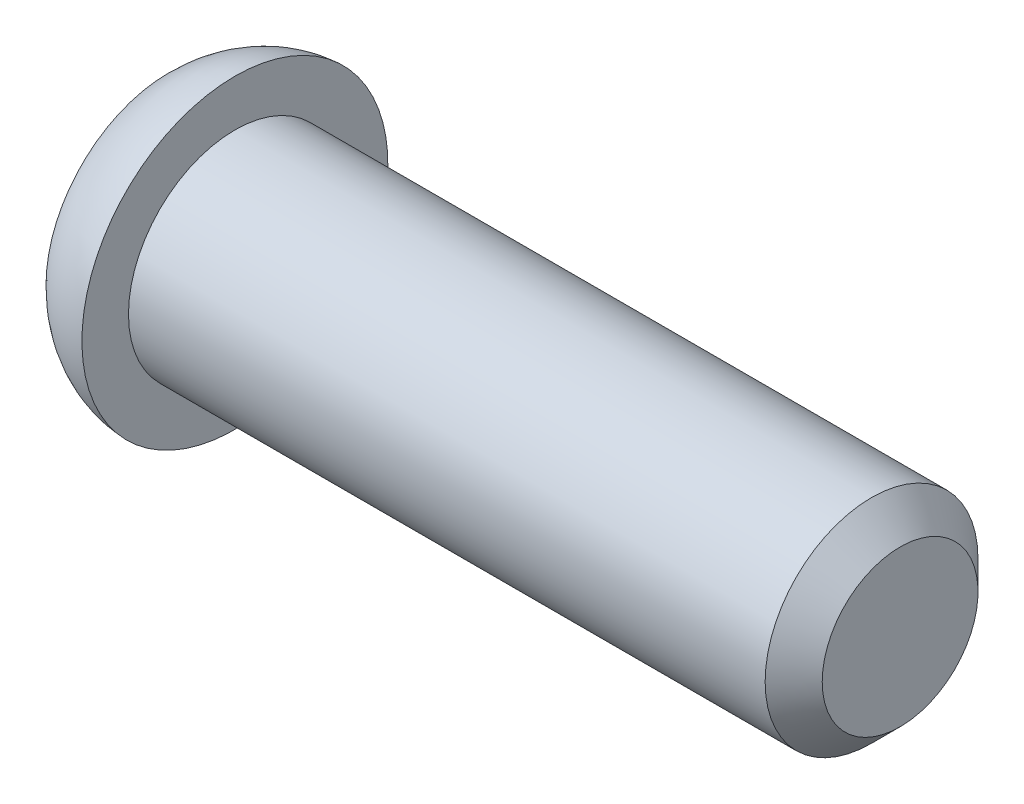
ISO-10303-21;
HEADER;
FILE_DESCRIPTION(('STEP AP214'),'2;1');
FILE_NAME('part.step','',(''),(''),'','','');
FILE_SCHEMA(('AUTOMOTIVE_DESIGN { 1 0 10303 214 1 1 1 1 }'));
ENDSEC;
DATA;
#1=APPLICATION_CONTEXT('core data for automotive mechanical design processes');
#2=APPLICATION_PROTOCOL_DEFINITION('international standard','automotive_design',2000,#1);
#3=PRODUCT_CONTEXT('',#1,'mechanical');
#4=PRODUCT('Part','Part','',(#3));
#5=PRODUCT_RELATED_PRODUCT_CATEGORY('part','',(#4));
#6=PRODUCT_DEFINITION_FORMATION('','',#4);
#7=PRODUCT_DEFINITION_CONTEXT('part definition',#1,'design');
#8=PRODUCT_DEFINITION('design','',#6,#7);
#9=PRODUCT_DEFINITION_SHAPE('','',#8);
#10=(LENGTH_UNIT() NAMED_UNIT(*) SI_UNIT(.MILLI.,.METRE.));
#11=(NAMED_UNIT(*) PLANE_ANGLE_UNIT() SI_UNIT($,.RADIAN.));
#12=(NAMED_UNIT(*) SI_UNIT($,.STERADIAN.) SOLID_ANGLE_UNIT());
#13=UNCERTAINTY_MEASURE_WITH_UNIT(LENGTH_MEASURE(1.E-05),#10,'distance_accuracy_value','');
#14=(GEOMETRIC_REPRESENTATION_CONTEXT(3) GLOBAL_UNCERTAINTY_ASSIGNED_CONTEXT((#13)) GLOBAL_UNIT_ASSIGNED_CONTEXT((#10,
#11,#12)) REPRESENTATION_CONTEXT('',''));
#15=CARTESIAN_POINT('',(0.,0.,0.));
#16=DIRECTION('',(0.,0.,1.));
#17=DIRECTION('',(1.,0.,0.));
#18=AXIS2_PLACEMENT_3D('',#15,#16,#17);
#19=CARTESIAN_POINT('',(0.25,0.115,0.345));
#20=DIRECTION('',(-0.940190624657783,0.,-0.340648777049922));
#21=DIRECTION('',(-0.340648777049922,0.,0.940190624657783));
#22=AXIS2_PLACEMENT_3D('',#19,#20,#21);
#23=PLANE('',#22);
#24=DIRECTION('',(0.340648777049924,0.,-0.940190624657782));
#25=VECTOR('',#24,1.);
#26=CARTESIAN_POINT('',(0.333333333333333,-0.115,0.115));
#27=LINE('',#26,#25);
#28=CARTESIAN_POINT('',(0.333333333333333,-0.115,0.115));
#29=VERTEX_POINT('',#28);
#30=CARTESIAN_POINT('',(0.375,-0.115,0.));
#31=VERTEX_POINT('',#30);
#32=EDGE_CURVE('E125',#29,#31,#27,.T.);
#33=ORIENTED_EDGE('',*,*,#32,.F.);
#34=DIRECTION('',(-0.248182513422005,-0.684983737044733,0.684983737044733));
#35=VECTOR('',#34,1.);
#36=CARTESIAN_POINT('',(0.375,0.,0.));
#37=LINE('',#36,#35);
#38=CARTESIAN_POINT('',(0.375,0.,0.));
#39=VERTEX_POINT('',#38);
#40=EDGE_CURVE('E122',#39,#29,#37,.T.);
#41=ORIENTED_EDGE('',*,*,#40,.F.);
#42=DIRECTION('',(0.,1.,0.));
#43=VECTOR('',#42,1.);
#44=CARTESIAN_POINT('',(0.375,0.115,0.));
#45=LINE('',#44,#43);
#46=EDGE_CURVE('E119',#31,#39,#45,.T.);
#47=ORIENTED_EDGE('',*,*,#46,.F.);
#48=EDGE_LOOP('',(#33,#41,#47));
#49=FACE_BOUND('',#48,.T.);
#50=ADVANCED_FACE('F16',(#49),#23,.T.);
#51=CARTESIAN_POINT('',(0.375,0.115,0.));
#52=DIRECTION('',(-0.940190624657783,0.,0.340648777049922));
#53=DIRECTION('',(0.340648777049922,0.,0.940190624657783));
#54=AXIS2_PLACEMENT_3D('',#51,#52,#53);
#55=PLANE('',#54);
#56=ORIENTED_EDGE('',*,*,#46,.T.);
#57=DIRECTION('',(0.248182513422005,0.684983737044733,0.684983737044733));
#58=VECTOR('',#57,1.);
#59=CARTESIAN_POINT('',(0.333333333333333,-0.115,-0.115));
#60=LINE('',#59,#58);
#61=CARTESIAN_POINT('',(0.333333333333333,-0.115,-0.115));
#62=VERTEX_POINT('',#61);
#63=EDGE_CURVE('E162',#62,#39,#60,.T.);
#64=ORIENTED_EDGE('',*,*,#63,.F.);
#65=DIRECTION('',(-0.340648777049924,0.,-0.940190624657782));
#66=VECTOR('',#65,1.);
#67=CARTESIAN_POINT('',(0.375,-0.115,0.));
#68=LINE('',#67,#66);
#69=EDGE_CURVE('E169',#31,#62,#68,.T.);
#70=ORIENTED_EDGE('',*,*,#69,.F.);
#71=EDGE_LOOP('',(#56,#64,#70));
#72=FACE_BOUND('',#71,.T.);
#73=ADVANCED_FACE('F165',(#72),#55,.T.);
#74=CARTESIAN_POINT('',(0.25,-0.345,0.115));
#75=DIRECTION('',(-0.940190624657783,0.340648777049922,0.));
#76=DIRECTION('',(-0.340648777049922,-0.940190624657783,0.));
#77=AXIS2_PLACEMENT_3D('',#74,#75,#76);
#78=PLANE('',#77);
#79=ORIENTED_EDGE('',*,*,#40,.T.);
#80=DIRECTION('',(0.340648777049924,0.940190624657782,0.));
#81=VECTOR('',#80,1.);
#82=CARTESIAN_POINT('',(0.333333333333333,-0.115,0.115));
#83=LINE('',#82,#81);
#84=CARTESIAN_POINT('',(0.375,0.,0.115));
#85=VERTEX_POINT('',#84);
#86=EDGE_CURVE('E134',#29,#85,#83,.T.);
#87=ORIENTED_EDGE('',*,*,#86,.T.);
#88=DIRECTION('',(0.,0.,1.));
#89=VECTOR('',#88,1.);
#90=CARTESIAN_POINT('',(0.375,0.,0.115));
#91=LINE('',#90,#89);
#92=EDGE_CURVE('E128',#39,#85,#91,.T.);
#93=ORIENTED_EDGE('',*,*,#92,.F.);
#94=EDGE_LOOP('',(#79,#87,#93));
#95=FACE_BOUND('',#94,.T.);
#96=ADVANCED_FACE('F132',(#95),#78,.T.);
#97=CARTESIAN_POINT('',(0.375,0.,0.115));
#98=DIRECTION('',(-0.940190624657783,-0.340648777049922,0.));
#99=DIRECTION('',(0.340648777049922,-0.940190624657783,0.));
#100=AXIS2_PLACEMENT_3D('',#97,#98,#99);
#101=PLANE('',#100);
#102=DIRECTION('',(-0.248182513422005,0.684983737044733,0.684983737044733));
#103=VECTOR('',#102,1.);
#104=CARTESIAN_POINT('',(0.375,0.,0.));
#105=LINE('',#104,#103);
#106=CARTESIAN_POINT('',(0.333333333333333,0.115,0.115));
#107=VERTEX_POINT('',#106);
#108=EDGE_CURVE('E137',#39,#107,#105,.T.);
#109=ORIENTED_EDGE('',*,*,#108,.F.);
#110=ORIENTED_EDGE('',*,*,#92,.T.);
#111=DIRECTION('',(-0.340648777049924,0.940190624657782,0.));
#112=VECTOR('',#111,1.);
#113=CARTESIAN_POINT('',(0.375,0.,0.115));
#114=LINE('',#113,#112);
#115=EDGE_CURVE('E142',#85,#107,#114,.T.);
#116=ORIENTED_EDGE('',*,*,#115,.T.);
#117=EDGE_LOOP('',(#109,#110,#116));
#118=FACE_BOUND('',#117,.T.);
#119=ADVANCED_FACE('F141',(#118),#101,.T.);
#120=CARTESIAN_POINT('',(0.25,0.115,0.345));
#121=DIRECTION('',(-0.940190624657783,0.,-0.340648777049922));
#122=DIRECTION('',(-0.340648777049922,0.,0.940190624657783));
#123=AXIS2_PLACEMENT_3D('',#120,#121,#122);
#124=PLANE('',#123);
#125=DIRECTION('',(0.,1.,0.));
#126=VECTOR('',#125,1.);
#127=CARTESIAN_POINT('',(0.375,0.115,0.));
#128=LINE('',#127,#126);
#129=CARTESIAN_POINT('',(0.375,0.115,0.));
#130=VERTEX_POINT('',#129);
#131=EDGE_CURVE('E145',#39,#130,#128,.T.);
#132=ORIENTED_EDGE('',*,*,#131,.F.);
#133=ORIENTED_EDGE('',*,*,#108,.T.);
#134=DIRECTION('',(0.340648777049924,0.,-0.940190624657782));
#135=VECTOR('',#134,1.);
#136=CARTESIAN_POINT('',(0.333333333333333,0.115,0.115));
#137=LINE('',#136,#135);
#138=EDGE_CURVE('E151',#107,#130,#137,.T.);
#139=ORIENTED_EDGE('',*,*,#138,.T.);
#140=EDGE_LOOP('',(#132,#133,#139));
#141=FACE_BOUND('',#140,.T.);
#142=ADVANCED_FACE('F149',(#141),#124,.T.);
#143=CARTESIAN_POINT('',(0.375,0.115,0.));
#144=DIRECTION('',(-0.940190624657783,0.,0.340648777049922));
#145=DIRECTION('',(0.340648777049922,0.,0.940190624657783));
#146=AXIS2_PLACEMENT_3D('',#143,#144,#145);
#147=PLANE('',#146);
#148=DIRECTION('',(-0.340648777049924,0.,-0.940190624657782));
#149=VECTOR('',#148,1.);
#150=CARTESIAN_POINT('',(0.375,0.115,0.));
#151=LINE('',#150,#149);
#152=CARTESIAN_POINT('',(0.333333333333333,0.115,-0.115));
#153=VERTEX_POINT('',#152);
#154=EDGE_CURVE('E158',#130,#153,#151,.T.);
#155=ORIENTED_EDGE('',*,*,#154,.T.);
#156=DIRECTION('',(-0.248182513422005,0.684983737044733,-0.684983737044733));
#157=VECTOR('',#156,1.);
#158=CARTESIAN_POINT('',(0.375,0.,0.));
#159=LINE('',#158,#157);
#160=EDGE_CURVE('E154',#39,#153,#159,.T.);
#161=ORIENTED_EDGE('',*,*,#160,.F.);
#162=ORIENTED_EDGE('',*,*,#131,.T.);
#163=EDGE_LOOP('',(#155,#161,#162));
#164=FACE_BOUND('',#163,.T.);
#165=ADVANCED_FACE('F157',(#164),#147,.T.);
#166=CARTESIAN_POINT('',(0.375,0.,0.115));
#167=DIRECTION('',(-0.940190624657783,-0.340648777049922,0.));
#168=DIRECTION('',(0.340648777049922,-0.940190624657783,0.));
#169=AXIS2_PLACEMENT_3D('',#166,#167,#168);
#170=PLANE('',#169);
#171=ORIENTED_EDGE('',*,*,#160,.T.);
#172=DIRECTION('',(-0.340648777049924,0.940190624657782,0.));
#173=VECTOR('',#172,1.);
#174=CARTESIAN_POINT('',(0.375,0.,-0.115));
#175=LINE('',#174,#173);
#176=CARTESIAN_POINT('',(0.375,0.,-0.115));
#177=VERTEX_POINT('',#176);
#178=EDGE_CURVE('E175',#177,#153,#175,.T.);
#179=ORIENTED_EDGE('',*,*,#178,.F.);
#180=DIRECTION('',(0.,0.,1.));
#181=VECTOR('',#180,1.);
#182=CARTESIAN_POINT('',(0.375,0.,0.115));
#183=LINE('',#182,#181);
#184=EDGE_CURVE('E172',#39,#177,#183,.F.);
#185=ORIENTED_EDGE('',*,*,#184,.F.);
#186=EDGE_LOOP('',(#171,#179,#185));
#187=FACE_BOUND('',#186,.T.);
#188=ADVANCED_FACE('F173',(#187),#170,.T.);
#189=CARTESIAN_POINT('',(0.25,-0.345,0.115));
#190=DIRECTION('',(-0.940190624657783,0.340648777049922,0.));
#191=DIRECTION('',(-0.340648777049922,-0.940190624657783,0.));
#192=AXIS2_PLACEMENT_3D('',#189,#190,#191);
#193=PLANE('',#192);
#194=ORIENTED_EDGE('',*,*,#63,.T.);
#195=ORIENTED_EDGE('',*,*,#184,.T.);
#196=DIRECTION('',(0.340648777049924,0.940190624657782,0.));
#197=VECTOR('',#196,1.);
#198=CARTESIAN_POINT('',(0.333333333333333,-0.115,-0.115));
#199=LINE('',#198,#197);
#200=EDGE_CURVE('E180',#62,#177,#199,.T.);
#201=ORIENTED_EDGE('',*,*,#200,.F.);
#202=EDGE_LOOP('',(#194,#195,#201));
#203=FACE_BOUND('',#202,.T.);
#204=ADVANCED_FACE('F179',(#203),#193,.T.);
#205=CARTESIAN_POINT('',(0.,-0.115,0.));
#206=DIRECTION('',(0.,1.,0.));
#207=DIRECTION('',(0.,0.,1.));
#208=AXIS2_PLACEMENT_3D('',#205,#206,#207);
#209=PLANE('',#208);
#210=ORIENTED_EDGE('',*,*,#69,.T.);
#211=DIRECTION('',(0.,0.,1.));
#212=VECTOR('',#211,1.);
#213=CARTESIAN_POINT('',(0.333333333333333,-0.115,0.115));
#214=LINE('',#213,#212);
#215=EDGE_CURVE('E301',#29,#62,#214,.F.);
#216=ORIENTED_EDGE('',*,*,#215,.F.);
#217=ORIENTED_EDGE('',*,*,#32,.T.);
#218=EDGE_LOOP('',(#210,#216,#217));
#219=FACE_BOUND('',#218,.T.);
#220=ADVANCED_FACE('F311',(#219),#209,.T.);
#221=CARTESIAN_POINT('',(0.,0.,0.115));
#222=DIRECTION('',(0.,0.,1.));
#223=DIRECTION('',(1.,0.,0.));
#224=AXIS2_PLACEMENT_3D('',#221,#222,#223);
#225=PLANE('',#224);
#226=ORIENTED_EDGE('',*,*,#115,.F.);
#227=ORIENTED_EDGE('',*,*,#86,.F.);
#228=DIRECTION('',(0.,1.,0.));
#229=VECTOR('',#228,1.);
#230=CARTESIAN_POINT('',(0.333333333333333,0.115,0.115));
#231=LINE('',#230,#229);
#232=EDGE_CURVE('E298',#107,#29,#231,.F.);
#233=ORIENTED_EDGE('',*,*,#232,.F.);
#234=EDGE_LOOP('',(#226,#227,#233));
#235=FACE_BOUND('',#234,.T.);
#236=ADVANCED_FACE('F316',(#235),#225,.F.);
#237=CARTESIAN_POINT('',(0.,0.115,0.));
#238=DIRECTION('',(0.,1.,0.));
#239=DIRECTION('',(0.,0.,1.));
#240=AXIS2_PLACEMENT_3D('',#237,#238,#239);
#241=PLANE('',#240);
#242=ORIENTED_EDGE('',*,*,#154,.F.);
#243=ORIENTED_EDGE('',*,*,#138,.F.);
#244=DIRECTION('',(0.,0.,1.));
#245=VECTOR('',#244,1.);
#246=CARTESIAN_POINT('',(0.333333333333333,0.115,0.115));
#247=LINE('',#246,#245);
#248=EDGE_CURVE('E295',#153,#107,#247,.T.);
#249=ORIENTED_EDGE('',*,*,#248,.F.);
#250=EDGE_LOOP('',(#242,#243,#249));
#251=FACE_BOUND('',#250,.T.);
#252=ADVANCED_FACE('F364',(#251),#241,.F.);
#253=CARTESIAN_POINT('',(0.,0.,-0.115));
#254=DIRECTION('',(0.,0.,1.));
#255=DIRECTION('',(1.,0.,0.));
#256=AXIS2_PLACEMENT_3D('',#253,#254,#255);
#257=PLANE('',#256);
#258=DIRECTION('',(0.,1.,0.));
#259=VECTOR('',#258,1.);
#260=CARTESIAN_POINT('',(0.333333333333333,0.115,-0.115));
#261=LINE('',#260,#259);
#262=EDGE_CURVE('E292',#62,#153,#261,.T.);
#263=ORIENTED_EDGE('',*,*,#262,.F.);
#264=ORIENTED_EDGE('',*,*,#200,.T.);
#265=ORIENTED_EDGE('',*,*,#178,.T.);
#266=EDGE_LOOP('',(#263,#264,#265));
#267=FACE_BOUND('',#266,.T.);
#268=ADVANCED_FACE('F362',(#267),#257,.T.);
#269=CARTESIAN_POINT('',(0.25,-0.345,0.115));
#270=DIRECTION('',(-0.940190624657783,0.340648777049922,0.));
#271=DIRECTION('',(-0.340648777049922,-0.940190624657783,0.));
#272=AXIS2_PLACEMENT_3D('',#269,#270,#271);
#273=PLANE('',#272);
#274=DIRECTION('',(0.34064877704992,0.940190624657784,0.));
#275=VECTOR('',#274,1.);
#276=CARTESIAN_POINT('',(0.25,-0.345,-0.115));
#277=LINE('',#276,#275);
#278=CARTESIAN_POINT('',(0.25,-0.345,-0.115));
#279=VERTEX_POINT('',#278);
#280=EDGE_CURVE('E287',#279,#62,#277,.T.);
#281=ORIENTED_EDGE('',*,*,#280,.F.);
#282=DIRECTION('',(0.,0.,1.));
#283=VECTOR('',#282,1.);
#284=CARTESIAN_POINT('',(0.25,-0.345,0.115));
#285=LINE('',#284,#283);
#286=CARTESIAN_POINT('',(0.25,-0.345,0.115));
#287=VERTEX_POINT('',#286);
#288=EDGE_CURVE('E278',#287,#279,#285,.F.);
#289=ORIENTED_EDGE('',*,*,#288,.F.);
#290=DIRECTION('',(0.34064877704992,0.940190624657784,0.));
#291=VECTOR('',#290,1.);
#292=CARTESIAN_POINT('',(0.25,-0.345,0.115));
#293=LINE('',#292,#291);
#294=EDGE_CURVE('E272',#287,#29,#293,.T.);
#295=ORIENTED_EDGE('',*,*,#294,.T.);
#296=ORIENTED_EDGE('',*,*,#215,.T.);
#297=EDGE_LOOP('',(#281,#289,#295,#296));
#298=FACE_BOUND('',#297,.T.);
#299=ADVANCED_FACE('F319',(#298),#273,.T.);
#300=CARTESIAN_POINT('',(0.25,0.115,0.345));
#301=DIRECTION('',(-0.940190624657783,0.,-0.340648777049922));
#302=DIRECTION('',(-0.340648777049922,0.,0.940190624657783));
#303=AXIS2_PLACEMENT_3D('',#300,#301,#302);
#304=PLANE('',#303);
#305=DIRECTION('',(0.,1.,0.));
#306=VECTOR('',#305,1.);
#307=CARTESIAN_POINT('',(0.25,0.115,0.345));
#308=LINE('',#307,#306);
#309=CARTESIAN_POINT('',(0.25,0.115,0.345));
#310=VERTEX_POINT('',#309);
#311=CARTESIAN_POINT('',(0.25,-0.115,0.345));
#312=VERTEX_POINT('',#311);
#313=EDGE_CURVE('E260',#310,#312,#308,.F.);
#314=ORIENTED_EDGE('',*,*,#313,.F.);
#315=DIRECTION('',(0.34064877704992,0.,-0.940190624657784));
#316=VECTOR('',#315,1.);
#317=CARTESIAN_POINT('',(0.25,0.115,0.345));
#318=LINE('',#317,#316);
#319=EDGE_CURVE('E254',#310,#107,#318,.T.);
#320=ORIENTED_EDGE('',*,*,#319,.T.);
#321=ORIENTED_EDGE('',*,*,#232,.T.);
#322=DIRECTION('',(0.34064877704992,0.,-0.940190624657784));
#323=VECTOR('',#322,1.);
#324=CARTESIAN_POINT('',(0.25,-0.115,0.345));
#325=LINE('',#324,#323);
#326=EDGE_CURVE('E266',#312,#29,#325,.T.);
#327=ORIENTED_EDGE('',*,*,#326,.F.);
#328=EDGE_LOOP('',(#314,#320,#321,#327));
#329=FACE_BOUND('',#328,.T.);
#330=ADVANCED_FACE('F327',(#329),#304,.T.);
#331=CARTESIAN_POINT('',(0.375,0.,0.115));
#332=DIRECTION('',(-0.940190624657783,-0.340648777049922,0.));
#333=DIRECTION('',(0.340648777049922,-0.940190624657783,0.));
#334=AXIS2_PLACEMENT_3D('',#331,#332,#333);
#335=PLANE('',#334);
#336=DIRECTION('',(0.,0.,1.));
#337=VECTOR('',#336,1.);
#338=CARTESIAN_POINT('',(0.25,0.345,0.115));
#339=LINE('',#338,#337);
#340=CARTESIAN_POINT('',(0.25,0.345,-0.115));
#341=VERTEX_POINT('',#340);
#342=CARTESIAN_POINT('',(0.25,0.345,0.115));
#343=VERTEX_POINT('',#342);
#344=EDGE_CURVE('E246',#341,#343,#339,.T.);
#345=ORIENTED_EDGE('',*,*,#344,.F.);
#346=DIRECTION('',(-0.34064877704992,0.940190624657784,0.));
#347=VECTOR('',#346,1.);
#348=CARTESIAN_POINT('',(0.333333333333333,0.115,-0.115));
#349=LINE('',#348,#347);
#350=EDGE_CURVE('E240',#153,#341,#349,.T.);
#351=ORIENTED_EDGE('',*,*,#350,.F.);
#352=ORIENTED_EDGE('',*,*,#248,.T.);
#353=DIRECTION('',(-0.34064877704992,0.940190624657784,0.));
#354=VECTOR('',#353,1.);
#355=CARTESIAN_POINT('',(0.333333333333333,0.115,0.115));
#356=LINE('',#355,#354);
#357=EDGE_CURVE('E249',#107,#343,#356,.T.);
#358=ORIENTED_EDGE('',*,*,#357,.T.);
#359=EDGE_LOOP('',(#345,#351,#352,#358));
#360=FACE_BOUND('',#359,.T.);
#361=ADVANCED_FACE('F344',(#360),#335,.T.);
#362=CARTESIAN_POINT('',(0.375,0.115,0.));
#363=DIRECTION('',(-0.940190624657783,0.,0.340648777049922));
#364=DIRECTION('',(0.340648777049922,0.,0.940190624657783));
#365=AXIS2_PLACEMENT_3D('',#362,#363,#364);
#366=PLANE('',#365);
#367=DIRECTION('',(-0.34064877704992,0.,-0.940190624657784));
#368=VECTOR('',#367,1.);
#369=CARTESIAN_POINT('',(0.333333333333333,-0.115,-0.115));
#370=LINE('',#369,#368);
#371=CARTESIAN_POINT('',(0.25,-0.115,-0.345));
#372=VERTEX_POINT('',#371);
#373=EDGE_CURVE('E290',#62,#372,#370,.T.);
#374=ORIENTED_EDGE('',*,*,#373,.F.);
#375=ORIENTED_EDGE('',*,*,#262,.T.);
#376=DIRECTION('',(-0.34064877704992,0.,-0.940190624657784));
#377=VECTOR('',#376,1.);
#378=CARTESIAN_POINT('',(0.333333333333333,0.115,-0.115));
#379=LINE('',#378,#377);
#380=CARTESIAN_POINT('',(0.25,0.115,-0.345));
#381=VERTEX_POINT('',#380);
#382=EDGE_CURVE('E235',#153,#381,#379,.T.);
#383=ORIENTED_EDGE('',*,*,#382,.T.);
#384=DIRECTION('',(0.,1.,0.));
#385=VECTOR('',#384,1.);
#386=CARTESIAN_POINT('',(0.25,0.115,-0.345));
#387=LINE('',#386,#385);
#388=EDGE_CURVE('E227',#372,#381,#387,.T.);
#389=ORIENTED_EDGE('',*,*,#388,.F.);
#390=EDGE_LOOP('',(#374,#375,#383,#389));
#391=FACE_BOUND('',#390,.T.);
#392=ADVANCED_FACE('F360',(#391),#366,.T.);
#393=CARTESIAN_POINT('',(0.,-0.115,0.));
#394=DIRECTION('',(0.,1.,0.));
#395=DIRECTION('',(0.,0.,1.));
#396=AXIS2_PLACEMENT_3D('',#393,#394,#395);
#397=PLANE('',#396);
#398=DIRECTION('',(0.,0.,-1.));
#399=VECTOR('',#398,1.);
#400=CARTESIAN_POINT('',(-0.5,-0.115,0.));
#401=LINE('',#400,#399);
#402=CARTESIAN_POINT('',(-0.5,-0.115,-0.69));
#403=VERTEX_POINT('',#402);
#404=CARTESIAN_POINT('',(-0.5,-0.115,-0.115));
#405=VERTEX_POINT('',#404);
#406=EDGE_CURVE('E223',#403,#405,#401,.F.);
#407=ORIENTED_EDGE('',*,*,#406,.T.);
#408=DIRECTION('',(1.,0.,0.));
#409=VECTOR('',#408,1.);
#410=CARTESIAN_POINT('',(0.,-0.115,-0.115));
#411=LINE('',#410,#409);
#412=EDGE_CURVE('E284',#62,#405,#411,.F.);
#413=ORIENTED_EDGE('',*,*,#412,.F.);
#414=ORIENTED_EDGE('',*,*,#373,.T.);
#415=DIRECTION('',(0.908490452678575,0.,0.417905608232145));
#416=VECTOR('',#415,1.);
#417=CARTESIAN_POINT('',(0.25,-0.115,-0.345));
#418=LINE('',#417,#416);
#419=EDGE_CURVE('E230',#403,#372,#418,.T.);
#420=ORIENTED_EDGE('',*,*,#419,.F.);
#421=EDGE_LOOP('',(#407,#413,#414,#420));
#422=FACE_BOUND('',#421,.T.);
#423=ADVANCED_FACE('F423',(#422),#397,.T.);
#424=CARTESIAN_POINT('',(0.,0.,-0.115));
#425=DIRECTION('',(0.,0.,1.));
#426=DIRECTION('',(1.,0.,0.));
#427=AXIS2_PLACEMENT_3D('',#424,#425,#426);
#428=PLANE('',#427);
#429=DIRECTION('',(0.,1.,0.));
#430=VECTOR('',#429,1.);
#431=CARTESIAN_POINT('',(-0.5,0.,-0.115));
#432=LINE('',#431,#430);
#433=CARTESIAN_POINT('',(-0.5,-0.69,-0.115));
#434=VERTEX_POINT('',#433);
#435=EDGE_CURVE('E221',#405,#434,#432,.F.);
#436=ORIENTED_EDGE('',*,*,#435,.T.);
#437=DIRECTION('',(-0.908490452678575,-0.417905608232144,0.));
#438=VECTOR('',#437,1.);
#439=CARTESIAN_POINT('',(-0.5,-0.69,-0.115));
#440=LINE('',#439,#438);
#441=EDGE_CURVE('E281',#279,#434,#440,.T.);
#442=ORIENTED_EDGE('',*,*,#441,.F.);
#443=ORIENTED_EDGE('',*,*,#280,.T.);
#444=ORIENTED_EDGE('',*,*,#412,.T.);
#445=EDGE_LOOP('',(#436,#442,#443,#444));
#446=FACE_BOUND('',#445,.T.);
#447=ADVANCED_FACE('F419',(#446),#428,.T.);
#448=CARTESIAN_POINT('',(-0.5,-0.69,0.115));
#449=DIRECTION('',(-0.417905608232144,0.908490452678575,0.));
#450=DIRECTION('',(-0.908490452678575,-0.417905608232144,0.));
#451=AXIS2_PLACEMENT_3D('',#448,#449,#450);
#452=PLANE('',#451);
#453=DIRECTION('',(0.908490452678575,0.417905608232144,0.));
#454=VECTOR('',#453,1.);
#455=CARTESIAN_POINT('',(-0.5,-0.69,0.115));
#456=LINE('',#455,#454);
#457=CARTESIAN_POINT('',(-0.5,-0.69,0.115));
#458=VERTEX_POINT('',#457);
#459=EDGE_CURVE('E275',#458,#287,#456,.T.);
#460=ORIENTED_EDGE('',*,*,#459,.T.);
#461=ORIENTED_EDGE('',*,*,#288,.T.);
#462=ORIENTED_EDGE('',*,*,#441,.T.);
#463=DIRECTION('',(0.,0.,-1.));
#464=VECTOR('',#463,1.);
#465=CARTESIAN_POINT('',(-0.5,-0.69,0.));
#466=LINE('',#465,#464);
#467=EDGE_CURVE('E219',#434,#458,#466,.F.);
#468=ORIENTED_EDGE('',*,*,#467,.T.);
#469=EDGE_LOOP('',(#460,#461,#462,#468));
#470=FACE_BOUND('',#469,.T.);
#471=ADVANCED_FACE('F416',(#470),#452,.T.);
#472=CARTESIAN_POINT('',(0.,0.,0.115));
#473=DIRECTION('',(0.,0.,1.));
#474=DIRECTION('',(1.,0.,0.));
#475=AXIS2_PLACEMENT_3D('',#472,#473,#474);
#476=PLANE('',#475);
#477=ORIENTED_EDGE('',*,*,#294,.F.);
#478=ORIENTED_EDGE('',*,*,#459,.F.);
#479=DIRECTION('',(0.,1.,0.));
#480=VECTOR('',#479,1.);
#481=CARTESIAN_POINT('',(-0.5,0.,0.115));
#482=LINE('',#481,#480);
#483=CARTESIAN_POINT('',(-0.5,-0.115,0.115));
#484=VERTEX_POINT('',#483);
#485=EDGE_CURVE('E217',#458,#484,#482,.T.);
#486=ORIENTED_EDGE('',*,*,#485,.T.);
#487=DIRECTION('',(1.,0.,0.));
#488=VECTOR('',#487,1.);
#489=CARTESIAN_POINT('',(0.,-0.115,0.115));
#490=LINE('',#489,#488);
#491=EDGE_CURVE('E269',#29,#484,#490,.F.);
#492=ORIENTED_EDGE('',*,*,#491,.F.);
#493=EDGE_LOOP('',(#477,#478,#486,#492));
#494=FACE_BOUND('',#493,.T.);
#495=ADVANCED_FACE('F322',(#494),#476,.F.);
#496=CARTESIAN_POINT('',(0.,-0.115,0.));
#497=DIRECTION('',(0.,1.,0.));
#498=DIRECTION('',(0.,0.,1.));
#499=AXIS2_PLACEMENT_3D('',#496,#497,#498);
#500=PLANE('',#499);
#501=DIRECTION('',(-0.908490452678575,0.,0.417905608232144));
#502=VECTOR('',#501,1.);
#503=CARTESIAN_POINT('',(-0.5,-0.115,0.69));
#504=LINE('',#503,#502);
#505=CARTESIAN_POINT('',(-0.5,-0.115,0.69));
#506=VERTEX_POINT('',#505);
#507=EDGE_CURVE('E263',#312,#506,#504,.T.);
#508=ORIENTED_EDGE('',*,*,#507,.F.);
#509=ORIENTED_EDGE('',*,*,#326,.T.);
#510=ORIENTED_EDGE('',*,*,#491,.T.);
#511=DIRECTION('',(0.,0.,-1.));
#512=VECTOR('',#511,1.);
#513=CARTESIAN_POINT('',(-0.5,-0.115,0.));
#514=LINE('',#513,#512);
#515=EDGE_CURVE('E215',#484,#506,#514,.F.);
#516=ORIENTED_EDGE('',*,*,#515,.T.);
#517=EDGE_LOOP('',(#508,#509,#510,#516));
#518=FACE_BOUND('',#517,.T.);
#519=ADVANCED_FACE('F330',(#518),#500,.T.);
#520=CARTESIAN_POINT('',(-0.5,0.115,0.69));
#521=DIRECTION('',(-0.417905608232144,0.,-0.908490452678575));
#522=DIRECTION('',(-0.908490452678575,0.,0.417905608232144));
#523=AXIS2_PLACEMENT_3D('',#520,#521,#522);
#524=PLANE('',#523);
#525=DIRECTION('',(0.908490452678575,0.,-0.417905608232144));
#526=VECTOR('',#525,1.);
#527=CARTESIAN_POINT('',(-0.5,0.115,0.69));
#528=LINE('',#527,#526);
#529=CARTESIAN_POINT('',(-0.5,0.115,0.69));
#530=VERTEX_POINT('',#529);
#531=EDGE_CURVE('E257',#530,#310,#528,.T.);
#532=ORIENTED_EDGE('',*,*,#531,.T.);
#533=ORIENTED_EDGE('',*,*,#313,.T.);
#534=ORIENTED_EDGE('',*,*,#507,.T.);
#535=DIRECTION('',(0.,1.,0.));
#536=VECTOR('',#535,1.);
#537=CARTESIAN_POINT('',(-0.5,0.,0.69));
#538=LINE('',#537,#536);
#539=EDGE_CURVE('E213',#506,#530,#538,.T.);
#540=ORIENTED_EDGE('',*,*,#539,.T.);
#541=EDGE_LOOP('',(#532,#533,#534,#540));
#542=FACE_BOUND('',#541,.T.);
#543=ADVANCED_FACE('F333',(#542),#524,.T.);
#544=CARTESIAN_POINT('',(0.,0.115,0.));
#545=DIRECTION('',(0.,1.,0.));
#546=DIRECTION('',(0.,0.,1.));
#547=AXIS2_PLACEMENT_3D('',#544,#545,#546);
#548=PLANE('',#547);
#549=ORIENTED_EDGE('',*,*,#531,.F.);
#550=DIRECTION('',(0.,0.,-1.));
#551=VECTOR('',#550,1.);
#552=CARTESIAN_POINT('',(-0.5,0.115,0.));
#553=LINE('',#552,#551);
#554=CARTESIAN_POINT('',(-0.5,0.115,0.115));
#555=VERTEX_POINT('',#554);
#556=EDGE_CURVE('E211',#530,#555,#553,.T.);
#557=ORIENTED_EDGE('',*,*,#556,.T.);
#558=DIRECTION('',(1.,0.,0.));
#559=VECTOR('',#558,1.);
#560=CARTESIAN_POINT('',(0.,0.115,0.115));
#561=LINE('',#560,#559);
#562=EDGE_CURVE('E251',#555,#107,#561,.T.);
#563=ORIENTED_EDGE('',*,*,#562,.T.);
#564=ORIENTED_EDGE('',*,*,#319,.F.);
#565=EDGE_LOOP('',(#549,#557,#563,#564));
#566=FACE_BOUND('',#565,.T.);
#567=ADVANCED_FACE('F337',(#566),#548,.F.);
#568=CARTESIAN_POINT('',(0.,0.,0.115));
#569=DIRECTION('',(0.,0.,1.));
#570=DIRECTION('',(1.,0.,0.));
#571=AXIS2_PLACEMENT_3D('',#568,#569,#570);
#572=PLANE('',#571);
#573=ORIENTED_EDGE('',*,*,#562,.F.);
#574=DIRECTION('',(0.,1.,0.));
#575=VECTOR('',#574,1.);
#576=CARTESIAN_POINT('',(-0.5,0.,0.115));
#577=LINE('',#576,#575);
#578=CARTESIAN_POINT('',(-0.5,0.69,0.115));
#579=VERTEX_POINT('',#578);
#580=EDGE_CURVE('E209',#555,#579,#577,.T.);
#581=ORIENTED_EDGE('',*,*,#580,.T.);
#582=DIRECTION('',(0.908490452678575,-0.417905608232145,0.));
#583=VECTOR('',#582,1.);
#584=CARTESIAN_POINT('',(0.25,0.345,0.115));
#585=LINE('',#584,#583);
#586=EDGE_CURVE('E243',#343,#579,#585,.F.);
#587=ORIENTED_EDGE('',*,*,#586,.F.);
#588=ORIENTED_EDGE('',*,*,#357,.F.);
#589=EDGE_LOOP('',(#573,#581,#587,#588));
#590=FACE_BOUND('',#589,.T.);
#591=ADVANCED_FACE('F347',(#590),#572,.F.);
#592=CARTESIAN_POINT('',(0.25,0.345,0.115));
#593=DIRECTION('',(-0.417905608232145,-0.908490452678575,0.));
#594=DIRECTION('',(0.908490452678575,-0.417905608232145,0.));
#595=AXIS2_PLACEMENT_3D('',#592,#593,#594);
#596=PLANE('',#595);
#597=ORIENTED_EDGE('',*,*,#586,.T.);
#598=DIRECTION('',(0.,0.,-1.));
#599=VECTOR('',#598,1.);
#600=CARTESIAN_POINT('',(-0.5,0.69,0.));
#601=LINE('',#600,#599);
#602=CARTESIAN_POINT('',(-0.5,0.69,-0.115));
#603=VERTEX_POINT('',#602);
#604=EDGE_CURVE('E207',#579,#603,#601,.T.);
#605=ORIENTED_EDGE('',*,*,#604,.T.);
#606=DIRECTION('',(-0.908490452678575,0.417905608232144,0.));
#607=VECTOR('',#606,1.);
#608=CARTESIAN_POINT('',(0.25,0.345,-0.115));
#609=LINE('',#608,#607);
#610=EDGE_CURVE('E237',#341,#603,#609,.T.);
#611=ORIENTED_EDGE('',*,*,#610,.F.);
#612=ORIENTED_EDGE('',*,*,#344,.T.);
#613=EDGE_LOOP('',(#597,#605,#611,#612));
#614=FACE_BOUND('',#613,.T.);
#615=ADVANCED_FACE('F351',(#614),#596,.T.);
#616=CARTESIAN_POINT('',(0.,0.,-0.115));
#617=DIRECTION('',(0.,0.,1.));
#618=DIRECTION('',(1.,0.,0.));
#619=AXIS2_PLACEMENT_3D('',#616,#617,#618);
#620=PLANE('',#619);
#621=ORIENTED_EDGE('',*,*,#610,.T.);
#622=DIRECTION('',(0.,1.,0.));
#623=VECTOR('',#622,1.);
#624=CARTESIAN_POINT('',(-0.5,0.,-0.115));
#625=LINE('',#624,#623);
#626=CARTESIAN_POINT('',(-0.5,0.115,-0.115));
#627=VERTEX_POINT('',#626);
#628=EDGE_CURVE('E200',#603,#627,#625,.F.);
#629=ORIENTED_EDGE('',*,*,#628,.T.);
#630=DIRECTION('',(1.,0.,0.));
#631=VECTOR('',#630,1.);
#632=CARTESIAN_POINT('',(0.,0.115,-0.115));
#633=LINE('',#632,#631);
#634=EDGE_CURVE('E232',#627,#153,#633,.T.);
#635=ORIENTED_EDGE('',*,*,#634,.T.);
#636=ORIENTED_EDGE('',*,*,#350,.T.);
#637=EDGE_LOOP('',(#621,#629,#635,#636));
#638=FACE_BOUND('',#637,.T.);
#639=ADVANCED_FACE('F354',(#638),#620,.T.);
#640=CARTESIAN_POINT('',(0.,0.115,0.));
#641=DIRECTION('',(0.,1.,0.));
#642=DIRECTION('',(0.,0.,1.));
#643=AXIS2_PLACEMENT_3D('',#640,#641,#642);
#644=PLANE('',#643);
#645=DIRECTION('',(0.,0.,-1.));
#646=VECTOR('',#645,1.);
#647=CARTESIAN_POINT('',(-0.5,0.115,0.));
#648=LINE('',#647,#646);
#649=CARTESIAN_POINT('',(-0.5,0.115,-0.69));
#650=VERTEX_POINT('',#649);
#651=EDGE_CURVE('E35',#627,#650,#648,.T.);
#652=ORIENTED_EDGE('',*,*,#651,.T.);
#653=DIRECTION('',(0.908490452678575,0.,0.417905608232145));
#654=VECTOR('',#653,1.);
#655=CARTESIAN_POINT('',(0.25,0.115,-0.345));
#656=LINE('',#655,#654);
#657=EDGE_CURVE('E225',#381,#650,#656,.F.);
#658=ORIENTED_EDGE('',*,*,#657,.F.);
#659=ORIENTED_EDGE('',*,*,#382,.F.);
#660=ORIENTED_EDGE('',*,*,#634,.F.);
#661=EDGE_LOOP('',(#652,#658,#659,#660));
#662=FACE_BOUND('',#661,.T.);
#663=ADVANCED_FACE('F356',(#662),#644,.F.);
#664=CARTESIAN_POINT('',(0.25,0.115,-0.345));
#665=DIRECTION('',(-0.417905608232145,0.,0.908490452678575));
#666=DIRECTION('',(0.908490452678575,0.,0.417905608232145));
#667=AXIS2_PLACEMENT_3D('',#664,#665,#666);
#668=PLANE('',#667);
#669=ORIENTED_EDGE('',*,*,#657,.T.);
#670=DIRECTION('',(0.,1.,0.));
#671=VECTOR('',#670,1.);
#672=CARTESIAN_POINT('',(-0.5,0.,-0.69));
#673=LINE('',#672,#671);
#674=EDGE_CURVE('E191',#650,#403,#673,.F.);
#675=ORIENTED_EDGE('',*,*,#674,.T.);
#676=ORIENTED_EDGE('',*,*,#419,.T.);
#677=ORIENTED_EDGE('',*,*,#388,.T.);
#678=EDGE_LOOP('',(#669,#675,#676,#677));
#679=FACE_BOUND('',#678,.T.);
#680=ADVANCED_FACE('F396',(#679),#668,.T.);
#681=CARTESIAN_POINT('',(-0.5,0.,0.));
#682=DIRECTION('',(1.,0.,0.));
#683=DIRECTION('',(0.,0.,-1.));
#684=AXIS2_PLACEMENT_3D('',#681,#682,#683);
#685=PLANE('',#684);
#686=ORIENTED_EDGE('',*,*,#651,.F.);
#687=ORIENTED_EDGE('',*,*,#628,.F.);
#688=ORIENTED_EDGE('',*,*,#604,.F.);
#689=ORIENTED_EDGE('',*,*,#580,.F.);
#690=ORIENTED_EDGE('',*,*,#556,.F.);
#691=ORIENTED_EDGE('',*,*,#539,.F.);
#692=ORIENTED_EDGE('',*,*,#515,.F.);
#693=ORIENTED_EDGE('',*,*,#485,.F.);
#694=ORIENTED_EDGE('',*,*,#467,.F.);
#695=ORIENTED_EDGE('',*,*,#435,.F.);
#696=ORIENTED_EDGE('',*,*,#406,.F.);
#697=ORIENTED_EDGE('',*,*,#674,.F.);
#698=EDGE_LOOP('',(#686,#687,#688,#689,#690,#691,#692,#693,#694,#695,#696,#697));
#699=FACE_BOUND('',#698,.T.);
#700=CARTESIAN_POINT('',(-0.499999999999996,0.,0.));
#701=DIRECTION('',(1.,0.,0.));
#702=DIRECTION('',(0.,1.,0.));
#703=AXIS2_PLACEMENT_3D('',#700,#701,#702);
#704=CIRCLE('',#703,0.919999999999996);
#705=CARTESIAN_POINT('',(-0.499999999999996,0.919999999999996,0.));
#706=VERTEX_POINT('',#705);
#707=EDGE_CURVE('E20',#706,#706,#704,.T.);
#708=ORIENTED_EDGE('',*,*,#707,.F.);
#709=EDGE_LOOP('',(#708));
#710=FACE_BOUND('',#709,.T.);
#711=ADVANCED_FACE('F392',(#699,#710),#685,.F.);
#712=CARTESIAN_POINT('',(5.,0.5855,0.));
#713=DIRECTION('',(-1.,0.,0.));
#714=DIRECTION('',(0.,0.,1.));
#715=AXIS2_PLACEMENT_3D('',#712,#713,#714);
#716=PLANE('',#715);
#717=CARTESIAN_POINT('',(4.99999999999545,0.,0.));
#718=DIRECTION('',(-1.,0.,0.));
#719=DIRECTION('',(0.,0.,1.));
#720=AXIS2_PLACEMENT_3D('',#717,#718,#719);
#721=CIRCLE('',#720,0.585499999999683);
#722=CARTESIAN_POINT('',(4.99999999999545,0.,0.585499999999683));
#723=VERTEX_POINT('',#722);
#724=EDGE_CURVE('E186',#723,#723,#721,.T.);
#725=ORIENTED_EDGE('',*,*,#724,.F.);
#726=EDGE_LOOP('',(#725));
#727=FACE_BOUND('',#726,.T.);
#728=ADVANCED_FACE('F389',(#727),#716,.F.);
#729=CARTESIAN_POINT('',(0.0415696611153837,0.,0.));
#730=DIRECTION('',(1.,0.,0.));
#731=DIRECTION('',(0.,1.,0.));
#732=AXIS2_PLACEMENT_3D('',#729,#730,#731);
#733=DEGENERATE_TOROIDAL_SURFACE('',#732,0.401152910618767,0.75,.T.);
#734=CARTESIAN_POINT('',(0.,0.,0.));
#735=DIRECTION('',(1.,0.,0.));
#736=DIRECTION('',(0.,1.,0.));
#737=AXIS2_PLACEMENT_3D('',#734,#735,#736);
#738=CIRCLE('',#737,1.15000000000001);
#739=CARTESIAN_POINT('',(0.,1.15000000000001,0.));
#740=VERTEX_POINT('',#739);
#741=EDGE_CURVE('E184',#740,#740,#738,.F.);
#742=ORIENTED_EDGE('',*,*,#741,.T.);
#743=EDGE_LOOP('',(#742));
#744=FACE_BOUND('',#743,.T.);
#745=ORIENTED_EDGE('',*,*,#707,.T.);
#746=EDGE_LOOP('',(#745));
#747=FACE_BOUND('',#746,.T.);
#748=ADVANCED_FACE('F18',(#744,#747),#733,.T.);
#749=CARTESIAN_POINT('',(4.78550000008227,0.,0.));
#750=DIRECTION('',(-1.,0.,0.));
#751=DIRECTION('',(0.,0.,1.));
#752=AXIS2_PLACEMENT_3D('',#749,#750,#751);
#753=CONICAL_SURFACE('',#752,0.799999999856027,0.785398163264946);
#754=CARTESIAN_POINT('',(4.7855,0.,0.));
#755=DIRECTION('',(-1.,0.,0.));
#756=DIRECTION('',(0.,0.,1.));
#757=AXIS2_PLACEMENT_3D('',#754,#755,#756);
#758=CIRCLE('',#757,0.8);
#759=CARTESIAN_POINT('',(4.7855,0.,0.8));
#760=VERTEX_POINT('',#759);
#761=EDGE_CURVE('E26',#760,#760,#758,.T.);
#762=ORIENTED_EDGE('',*,*,#761,.F.);
#763=EDGE_LOOP('',(#762));
#764=FACE_BOUND('',#763,.T.);
#765=ORIENTED_EDGE('',*,*,#724,.T.);
#766=EDGE_LOOP('',(#765));
#767=FACE_BOUND('',#766,.T.);
#768=ADVANCED_FACE('F381',(#764,#767),#753,.T.);
#769=CARTESIAN_POINT('',(0.,1.15,0.));
#770=DIRECTION('',(-1.,0.,0.));
#771=DIRECTION('',(0.,0.,1.));
#772=AXIS2_PLACEMENT_3D('',#769,#770,#771);
#773=PLANE('',#772);
#774=ORIENTED_EDGE('',*,*,#741,.F.);
#775=EDGE_LOOP('',(#774));
#776=FACE_BOUND('',#775,.T.);
#777=CARTESIAN_POINT('',(0.,0.,0.));
#778=DIRECTION('',(-1.,0.,0.));
#779=DIRECTION('',(0.,0.,1.));
#780=AXIS2_PLACEMENT_3D('',#777,#778,#779);
#781=CIRCLE('',#780,0.8);
#782=CARTESIAN_POINT('',(0.,0.,0.8));
#783=VERTEX_POINT('',#782);
#784=EDGE_CURVE('E10',#783,#783,#781,.F.);
#785=ORIENTED_EDGE('',*,*,#784,.F.);
#786=EDGE_LOOP('',(#785));
#787=FACE_BOUND('',#786,.T.);
#788=ADVANCED_FACE('F375',(#776,#787),#773,.F.);
#789=CARTESIAN_POINT('',(5.,0.,0.));
#790=DIRECTION('',(-1.,0.,0.));
#791=DIRECTION('',(0.,0.,1.));
#792=AXIS2_PLACEMENT_3D('',#789,#790,#791);
#793=CYLINDRICAL_SURFACE('',#792,0.8);
#794=ORIENTED_EDGE('',*,*,#784,.T.);
#795=EDGE_LOOP('',(#794));
#796=FACE_BOUND('',#795,.T.);
#797=ORIENTED_EDGE('',*,*,#761,.T.);
#798=EDGE_LOOP('',(#797));
#799=FACE_BOUND('',#798,.T.);
#800=ADVANCED_FACE('F373',(#796,#799),#793,.T.);
#801=CLOSED_SHELL('',(#50,#73,#96,#119,#142,#165,#188,#204,#220,#236,#252,#268,#299,#330,#361,
#392,#423,#447,#471,#495,#519,#543,#567,#591,#615,#639,#663,#680,#711,#728,#748,#768,#788,#800));
#802=MANIFOLD_SOLID_BREP('B1',#801);
#803=ADVANCED_BREP_SHAPE_REPRESENTATION('',(#18,#802),#14);
#804=SHAPE_DEFINITION_REPRESENTATION(#9,#803);
ENDSEC;
END-ISO-10303-21;
